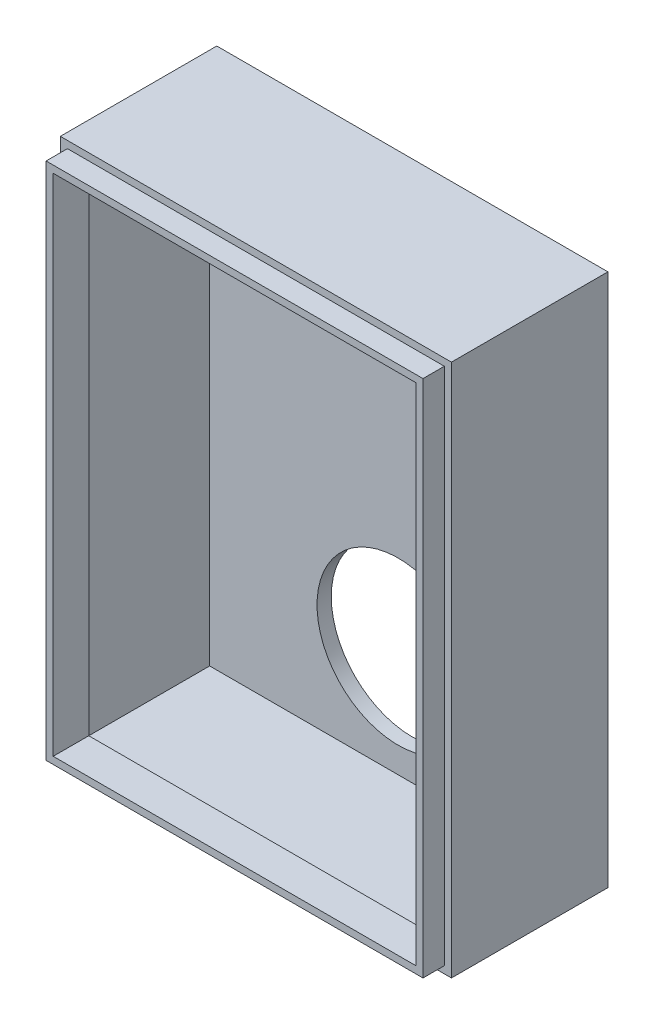
ISO-10303-21;
HEADER;
FILE_DESCRIPTION(('STEP AP214'),'2;1');
FILE_NAME('part.step','',(''),(''),'','','');
FILE_SCHEMA(('AUTOMOTIVE_DESIGN { 1 0 10303 214 1 1 1 1 }'));
ENDSEC;
DATA;
#1=APPLICATION_CONTEXT('core data for automotive mechanical design processes');
#2=APPLICATION_PROTOCOL_DEFINITION('international standard','automotive_design',2000,#1);
#3=PRODUCT_CONTEXT('',#1,'mechanical');
#4=PRODUCT('Part','Part','',(#3));
#5=PRODUCT_RELATED_PRODUCT_CATEGORY('part','',(#4));
#6=PRODUCT_DEFINITION_FORMATION('','',#4);
#7=PRODUCT_DEFINITION_CONTEXT('part definition',#1,'design');
#8=PRODUCT_DEFINITION('design','',#6,#7);
#9=PRODUCT_DEFINITION_SHAPE('','',#8);
#10=(LENGTH_UNIT() NAMED_UNIT(*) SI_UNIT(.MILLI.,.METRE.));
#11=(NAMED_UNIT(*) PLANE_ANGLE_UNIT() SI_UNIT($,.RADIAN.));
#12=(NAMED_UNIT(*) SI_UNIT($,.STERADIAN.) SOLID_ANGLE_UNIT());
#13=UNCERTAINTY_MEASURE_WITH_UNIT(LENGTH_MEASURE(1.E-05),#10,'distance_accuracy_value','');
#14=(GEOMETRIC_REPRESENTATION_CONTEXT(3) GLOBAL_UNCERTAINTY_ASSIGNED_CONTEXT((#13)) GLOBAL_UNIT_ASSIGNED_CONTEXT((#10,
#11,#12)) REPRESENTATION_CONTEXT('',''));
#15=CARTESIAN_POINT('',(0.,0.,0.));
#16=DIRECTION('',(0.,0.,1.));
#17=DIRECTION('',(1.,0.,0.));
#18=AXIS2_PLACEMENT_3D('',#15,#16,#17);
#19=CARTESIAN_POINT('',(1.,74.,20.));
#20=DIRECTION('',(-1.,0.,0.));
#21=DIRECTION('',(0.,-1.,0.));
#22=AXIS2_PLACEMENT_3D('',#19,#20,#21);
#23=PLANE('',#22);
#24=DIRECTION('',(0.,0.,1.));
#25=VECTOR('',#24,1.);
#26=CARTESIAN_POINT('',(1.00000000000001,1.,20.));
#27=LINE('',#26,#25);
#28=CARTESIAN_POINT('',(1.00000000000001,1.,20.));
#29=VERTEX_POINT('',#28);
#30=CARTESIAN_POINT('',(1.00000000000001,1.,25.));
#31=VERTEX_POINT('',#30);
#32=EDGE_CURVE('E48',#29,#31,#27,.T.);
#33=ORIENTED_EDGE('',*,*,#32,.T.);
#34=DIRECTION('',(0.,-1.,0.));
#35=VECTOR('',#34,1.);
#36=CARTESIAN_POINT('',(1.,74.,25.));
#37=LINE('',#36,#35);
#38=CARTESIAN_POINT('',(1.,74.,25.));
#39=VERTEX_POINT('',#38);
#40=EDGE_CURVE('E140',#39,#31,#37,.T.);
#41=ORIENTED_EDGE('',*,*,#40,.F.);
#42=DIRECTION('',(0.,0.,1.));
#43=VECTOR('',#42,1.);
#44=CARTESIAN_POINT('',(1.,74.,20.));
#45=LINE('',#44,#43);
#46=CARTESIAN_POINT('',(1.,74.,20.));
#47=VERTEX_POINT('',#46);
#48=EDGE_CURVE('E12',#47,#39,#45,.T.);
#49=ORIENTED_EDGE('',*,*,#48,.F.);
#50=DIRECTION('',(0.,-1.,0.));
#51=VECTOR('',#50,1.);
#52=CARTESIAN_POINT('',(1.,74.,20.));
#53=LINE('',#52,#51);
#54=EDGE_CURVE('E159',#47,#29,#53,.T.);
#55=ORIENTED_EDGE('',*,*,#54,.T.);
#56=EDGE_LOOP('',(#33,#41,#49,#55));
#57=FACE_BOUND('',#56,.T.);
#58=ADVANCED_FACE('F45',(#57),#23,.T.);
#59=CARTESIAN_POINT('',(1.,74.,20.));
#60=DIRECTION('',(0.,1.,0.));
#61=DIRECTION('',(0.,0.,1.));
#62=AXIS2_PLACEMENT_3D('',#59,#60,#61);
#63=PLANE('',#62);
#64=ORIENTED_EDGE('',*,*,#48,.T.);
#65=DIRECTION('',(-1.,0.,0.));
#66=VECTOR('',#65,1.);
#67=CARTESIAN_POINT('',(1.,74.,25.));
#68=LINE('',#67,#66);
#69=CARTESIAN_POINT('',(54.,74.,25.));
#70=VERTEX_POINT('',#69);
#71=EDGE_CURVE('E149',#70,#39,#68,.T.);
#72=ORIENTED_EDGE('',*,*,#71,.F.);
#73=DIRECTION('',(0.,0.,1.));
#74=VECTOR('',#73,1.);
#75=CARTESIAN_POINT('',(54.,74.,20.));
#76=LINE('',#75,#74);
#77=CARTESIAN_POINT('',(54.,74.,20.));
#78=VERTEX_POINT('',#77);
#79=EDGE_CURVE('E53',#78,#70,#76,.T.);
#80=ORIENTED_EDGE('',*,*,#79,.F.);
#81=DIRECTION('',(-1.,0.,0.));
#82=VECTOR('',#81,1.);
#83=CARTESIAN_POINT('',(1.,74.,20.));
#84=LINE('',#83,#82);
#85=EDGE_CURVE('E170',#78,#47,#84,.T.);
#86=ORIENTED_EDGE('',*,*,#85,.T.);
#87=EDGE_LOOP('',(#64,#72,#80,#86));
#88=FACE_BOUND('',#87,.T.);
#89=ADVANCED_FACE('F182',(#88),#63,.T.);
#90=CARTESIAN_POINT('',(54.,74.,20.));
#91=DIRECTION('',(1.,0.,0.));
#92=DIRECTION('',(0.,1.,0.));
#93=AXIS2_PLACEMENT_3D('',#90,#91,#92);
#94=PLANE('',#93);
#95=ORIENTED_EDGE('',*,*,#79,.T.);
#96=DIRECTION('',(0.,1.,0.));
#97=VECTOR('',#96,1.);
#98=CARTESIAN_POINT('',(54.,74.,25.));
#99=LINE('',#98,#97);
#100=CARTESIAN_POINT('',(54.,1.,25.));
#101=VERTEX_POINT('',#100);
#102=EDGE_CURVE('E146',#101,#70,#99,.T.);
#103=ORIENTED_EDGE('',*,*,#102,.F.);
#104=DIRECTION('',(0.,0.,1.));
#105=VECTOR('',#104,1.);
#106=CARTESIAN_POINT('',(54.,1.,20.));
#107=LINE('',#106,#105);
#108=CARTESIAN_POINT('',(54.,1.,20.));
#109=VERTEX_POINT('',#108);
#110=EDGE_CURVE('E173',#109,#101,#107,.T.);
#111=ORIENTED_EDGE('',*,*,#110,.F.);
#112=DIRECTION('',(0.,1.,0.));
#113=VECTOR('',#112,1.);
#114=CARTESIAN_POINT('',(54.,74.,20.));
#115=LINE('',#114,#113);
#116=EDGE_CURVE('E167',#109,#78,#115,.T.);
#117=ORIENTED_EDGE('',*,*,#116,.T.);
#118=EDGE_LOOP('',(#95,#103,#111,#117));
#119=FACE_BOUND('',#118,.T.);
#120=ADVANCED_FACE('F188',(#119),#94,.T.);
#121=CARTESIAN_POINT('',(1.00000000000001,1.,20.));
#122=DIRECTION('',(0.,-1.,0.));
#123=DIRECTION('',(1.,0.,0.));
#124=AXIS2_PLACEMENT_3D('',#121,#122,#123);
#125=PLANE('',#124);
#126=ORIENTED_EDGE('',*,*,#110,.T.);
#127=DIRECTION('',(1.,0.,0.));
#128=VECTOR('',#127,1.);
#129=CARTESIAN_POINT('',(1.00000000000001,1.,25.));
#130=LINE('',#129,#128);
#131=EDGE_CURVE('E143',#31,#101,#130,.T.);
#132=ORIENTED_EDGE('',*,*,#131,.F.);
#133=ORIENTED_EDGE('',*,*,#32,.F.);
#134=DIRECTION('',(1.,0.,0.));
#135=VECTOR('',#134,1.);
#136=CARTESIAN_POINT('',(1.00000000000001,1.,20.));
#137=LINE('',#136,#135);
#138=EDGE_CURVE('E164',#29,#109,#137,.T.);
#139=ORIENTED_EDGE('',*,*,#138,.T.);
#140=EDGE_LOOP('',(#126,#132,#133,#139));
#141=FACE_BOUND('',#140,.T.);
#142=ADVANCED_FACE('F177',(#141),#125,.T.);
#143=CARTESIAN_POINT('',(0.,0.,20.));
#144=DIRECTION('',(0.,0.,1.));
#145=DIRECTION('',(1.,0.,0.));
#146=AXIS2_PLACEMENT_3D('',#143,#144,#145);
#147=PLANE('',#146);
#148=DIRECTION('',(-1.,0.,0.));
#149=VECTOR('',#148,1.);
#150=CARTESIAN_POINT('',(2.,73.,20.));
#151=LINE('',#150,#149);
#152=CARTESIAN_POINT('',(53.,73.,20.));
#153=VERTEX_POINT('',#152);
#154=CARTESIAN_POINT('',(2.,73.,20.));
#155=VERTEX_POINT('',#154);
#156=EDGE_CURVE('E122',#153,#155,#151,.T.);
#157=ORIENTED_EDGE('',*,*,#156,.T.);
#158=DIRECTION('',(0.,-1.,0.));
#159=VECTOR('',#158,1.);
#160=CARTESIAN_POINT('',(2.,73.,20.));
#161=LINE('',#160,#159);
#162=CARTESIAN_POINT('',(2.00000000000001,2.,20.));
#163=VERTEX_POINT('',#162);
#164=EDGE_CURVE('E152',#155,#163,#161,.T.);
#165=ORIENTED_EDGE('',*,*,#164,.T.);
#166=DIRECTION('',(1.,0.,0.));
#167=VECTOR('',#166,1.);
#168=CARTESIAN_POINT('',(2.00000000000001,2.,20.));
#169=LINE('',#168,#167);
#170=CARTESIAN_POINT('',(53.,2.,20.));
#171=VERTEX_POINT('',#170);
#172=EDGE_CURVE('E117',#163,#171,#169,.T.);
#173=ORIENTED_EDGE('',*,*,#172,.T.);
#174=DIRECTION('',(0.,1.,0.));
#175=VECTOR('',#174,1.);
#176=CARTESIAN_POINT('',(53.,73.,20.));
#177=LINE('',#176,#175);
#178=EDGE_CURVE('E61',#171,#153,#177,.T.);
#179=ORIENTED_EDGE('',*,*,#178,.T.);
#180=EDGE_LOOP('',(#157,#165,#173,#179));
#181=FACE_BOUND('',#180,.T.);
#182=ORIENTED_EDGE('',*,*,#54,.F.);
#183=ORIENTED_EDGE('',*,*,#85,.F.);
#184=ORIENTED_EDGE('',*,*,#116,.F.);
#185=ORIENTED_EDGE('',*,*,#138,.F.);
#186=EDGE_LOOP('',(#182,#183,#184,#185));
#187=FACE_BOUND('',#186,.T.);
#188=ADVANCED_FACE('F186',(#181,#187),#147,.F.);
#189=CARTESIAN_POINT('',(2.,73.,20.));
#190=DIRECTION('',(-1.,0.,0.));
#191=DIRECTION('',(0.,-1.,0.));
#192=AXIS2_PLACEMENT_3D('',#189,#190,#191);
#193=PLANE('',#192);
#194=DIRECTION('',(0.,0.,1.));
#195=VECTOR('',#194,1.);
#196=CARTESIAN_POINT('',(2.,73.,20.));
#197=LINE('',#196,#195);
#198=CARTESIAN_POINT('',(2.,73.,25.));
#199=VERTEX_POINT('',#198);
#200=EDGE_CURVE('E127',#155,#199,#197,.T.);
#201=ORIENTED_EDGE('',*,*,#200,.T.);
#202=DIRECTION('',(0.,-1.,0.));
#203=VECTOR('',#202,1.);
#204=CARTESIAN_POINT('',(2.,73.,25.));
#205=LINE('',#204,#203);
#206=CARTESIAN_POINT('',(2.00000000000001,2.,25.));
#207=VERTEX_POINT('',#206);
#208=EDGE_CURVE('E125',#199,#207,#205,.T.);
#209=ORIENTED_EDGE('',*,*,#208,.T.);
#210=DIRECTION('',(0.,0.,1.));
#211=VECTOR('',#210,1.);
#212=CARTESIAN_POINT('',(2.00000000000001,2.,20.));
#213=LINE('',#212,#211);
#214=EDGE_CURVE('E110',#163,#207,#213,.T.);
#215=ORIENTED_EDGE('',*,*,#214,.F.);
#216=ORIENTED_EDGE('',*,*,#164,.F.);
#217=EDGE_LOOP('',(#201,#209,#215,#216));
#218=FACE_BOUND('',#217,.T.);
#219=ADVANCED_FACE('F126',(#218),#193,.F.);
#220=CARTESIAN_POINT('',(2.,73.,20.));
#221=DIRECTION('',(0.,1.,0.));
#222=DIRECTION('',(0.,0.,1.));
#223=AXIS2_PLACEMENT_3D('',#220,#221,#222);
#224=PLANE('',#223);
#225=DIRECTION('',(0.,0.,1.));
#226=VECTOR('',#225,1.);
#227=CARTESIAN_POINT('',(53.,73.,20.));
#228=LINE('',#227,#226);
#229=CARTESIAN_POINT('',(53.,73.,25.));
#230=VERTEX_POINT('',#229);
#231=EDGE_CURVE('E160',#153,#230,#228,.T.);
#232=ORIENTED_EDGE('',*,*,#231,.T.);
#233=DIRECTION('',(-1.,0.,0.));
#234=VECTOR('',#233,1.);
#235=CARTESIAN_POINT('',(2.,73.,25.));
#236=LINE('',#235,#234);
#237=EDGE_CURVE('E136',#230,#199,#236,.T.);
#238=ORIENTED_EDGE('',*,*,#237,.T.);
#239=ORIENTED_EDGE('',*,*,#200,.F.);
#240=ORIENTED_EDGE('',*,*,#156,.F.);
#241=EDGE_LOOP('',(#232,#238,#239,#240));
#242=FACE_BOUND('',#241,.T.);
#243=ADVANCED_FACE('F231',(#242),#224,.F.);
#244=CARTESIAN_POINT('',(53.,73.,20.));
#245=DIRECTION('',(1.,0.,0.));
#246=DIRECTION('',(0.,0.,-1.));
#247=AXIS2_PLACEMENT_3D('',#244,#245,#246);
#248=PLANE('',#247);
#249=DIRECTION('',(0.,0.,1.));
#250=VECTOR('',#249,1.);
#251=CARTESIAN_POINT('',(53.,2.,20.));
#252=LINE('',#251,#250);
#253=CARTESIAN_POINT('',(53.,2.,25.));
#254=VERTEX_POINT('',#253);
#255=EDGE_CURVE('E121',#171,#254,#252,.T.);
#256=ORIENTED_EDGE('',*,*,#255,.T.);
#257=DIRECTION('',(0.,1.,0.));
#258=VECTOR('',#257,1.);
#259=CARTESIAN_POINT('',(53.,73.,25.));
#260=LINE('',#259,#258);
#261=EDGE_CURVE('E134',#254,#230,#260,.T.);
#262=ORIENTED_EDGE('',*,*,#261,.T.);
#263=ORIENTED_EDGE('',*,*,#231,.F.);
#264=ORIENTED_EDGE('',*,*,#178,.F.);
#265=EDGE_LOOP('',(#256,#262,#263,#264));
#266=FACE_BOUND('',#265,.T.);
#267=ADVANCED_FACE('F240',(#266),#248,.F.);
#268=CARTESIAN_POINT('',(2.00000000000001,2.,20.));
#269=DIRECTION('',(0.,-1.,0.));
#270=DIRECTION('',(1.,0.,0.));
#271=AXIS2_PLACEMENT_3D('',#268,#269,#270);
#272=PLANE('',#271);
#273=ORIENTED_EDGE('',*,*,#214,.T.);
#274=DIRECTION('',(1.,0.,0.));
#275=VECTOR('',#274,1.);
#276=CARTESIAN_POINT('',(2.00000000000001,2.,25.));
#277=LINE('',#276,#275);
#278=EDGE_CURVE('E114',#207,#254,#277,.T.);
#279=ORIENTED_EDGE('',*,*,#278,.T.);
#280=ORIENTED_EDGE('',*,*,#255,.F.);
#281=ORIENTED_EDGE('',*,*,#172,.F.);
#282=EDGE_LOOP('',(#273,#279,#280,#281));
#283=FACE_BOUND('',#282,.T.);
#284=ADVANCED_FACE('F112',(#283),#272,.F.);
#285=CARTESIAN_POINT('',(0.,0.,25.));
#286=DIRECTION('',(0.,0.,1.));
#287=DIRECTION('',(1.,0.,0.));
#288=AXIS2_PLACEMENT_3D('',#285,#286,#287);
#289=PLANE('',#288);
#290=ORIENTED_EDGE('',*,*,#40,.T.);
#291=ORIENTED_EDGE('',*,*,#131,.T.);
#292=ORIENTED_EDGE('',*,*,#102,.T.);
#293=ORIENTED_EDGE('',*,*,#71,.T.);
#294=EDGE_LOOP('',(#290,#291,#292,#293));
#295=FACE_BOUND('',#294,.T.);
#296=ORIENTED_EDGE('',*,*,#278,.F.);
#297=ORIENTED_EDGE('',*,*,#208,.F.);
#298=ORIENTED_EDGE('',*,*,#237,.F.);
#299=ORIENTED_EDGE('',*,*,#261,.F.);
#300=EDGE_LOOP('',(#296,#297,#298,#299));
#301=FACE_BOUND('',#300,.T.);
#302=ADVANCED_FACE('F132',(#295,#301),#289,.T.);
#303=CLOSED_SHELL('',(#58,#89,#120,#142,#188,#219,#243,#267,#284,#302));
#304=MANIFOLD_SOLID_BREP('B2',#303);
#305=CARTESIAN_POINT('',(0.,0.,2.));
#306=DIRECTION('',(1.,0.,0.));
#307=DIRECTION('',(0.,0.,-1.));
#308=AXIS2_PLACEMENT_3D('',#305,#306,#307);
#309=PLANE('',#308);
#310=DIRECTION('',(0.,-1.,0.));
#311=VECTOR('',#310,1.);
#312=CARTESIAN_POINT('',(0.,0.,0.));
#313=LINE('',#312,#311);
#314=CARTESIAN_POINT('',(0.,75.,0.));
#315=VERTEX_POINT('',#314);
#316=CARTESIAN_POINT('',(0.,0.,0.));
#317=VERTEX_POINT('',#316);
#318=EDGE_CURVE('E394',#315,#317,#313,.T.);
#319=ORIENTED_EDGE('',*,*,#318,.T.);
#320=DIRECTION('',(0.,0.,-1.));
#321=VECTOR('',#320,1.);
#322=CARTESIAN_POINT('',(0.,0.,2.));
#323=LINE('',#322,#321);
#324=CARTESIAN_POINT('',(0.,0.,22.));
#325=VERTEX_POINT('',#324);
#326=EDGE_CURVE('E43',#325,#317,#323,.T.);
#327=ORIENTED_EDGE('',*,*,#326,.F.);
#328=DIRECTION('',(0.,-1.,0.));
#329=VECTOR('',#328,1.);
#330=CARTESIAN_POINT('',(0.,75.,22.));
#331=LINE('',#330,#329);
#332=CARTESIAN_POINT('',(0.,75.,22.));
#333=VERTEX_POINT('',#332);
#334=EDGE_CURVE('E357',#333,#325,#331,.T.);
#335=ORIENTED_EDGE('',*,*,#334,.F.);
#336=DIRECTION('',(0.,0.,-1.));
#337=VECTOR('',#336,1.);
#338=CARTESIAN_POINT('',(0.,75.,2.));
#339=LINE('',#338,#337);
#340=EDGE_CURVE('E402',#333,#315,#339,.T.);
#341=ORIENTED_EDGE('',*,*,#340,.T.);
#342=EDGE_LOOP('',(#319,#327,#335,#341));
#343=FACE_BOUND('',#342,.T.);
#344=ADVANCED_FACE('F275',(#343),#309,.F.);
#345=CARTESIAN_POINT('',(0.,0.,2.));
#346=DIRECTION('',(0.,1.,0.));
#347=DIRECTION('',(0.,0.,1.));
#348=AXIS2_PLACEMENT_3D('',#345,#346,#347);
#349=PLANE('',#348);
#350=DIRECTION('',(1.,0.,0.));
#351=VECTOR('',#350,1.);
#352=CARTESIAN_POINT('',(0.,0.,0.));
#353=LINE('',#352,#351);
#354=CARTESIAN_POINT('',(55.,0.,0.));
#355=VERTEX_POINT('',#354);
#356=EDGE_CURVE('E397',#317,#355,#353,.T.);
#357=ORIENTED_EDGE('',*,*,#356,.T.);
#358=DIRECTION('',(0.,0.,-1.));
#359=VECTOR('',#358,1.);
#360=CARTESIAN_POINT('',(55.,0.,2.));
#361=LINE('',#360,#359);
#362=CARTESIAN_POINT('',(55.,0.,22.));
#363=VERTEX_POINT('',#362);
#364=EDGE_CURVE('E282',#363,#355,#361,.T.);
#365=ORIENTED_EDGE('',*,*,#364,.F.);
#366=DIRECTION('',(1.,0.,0.));
#367=VECTOR('',#366,1.);
#368=CARTESIAN_POINT('',(0.,0.,22.));
#369=LINE('',#368,#367);
#370=EDGE_CURVE('E385',#325,#363,#369,.T.);
#371=ORIENTED_EDGE('',*,*,#370,.F.);
#372=ORIENTED_EDGE('',*,*,#326,.T.);
#373=EDGE_LOOP('',(#357,#365,#371,#372));
#374=FACE_BOUND('',#373,.T.);
#375=ADVANCED_FACE('F420',(#374),#349,.F.);
#376=CARTESIAN_POINT('',(55.,0.,2.));
#377=DIRECTION('',(-1.,0.,0.));
#378=DIRECTION('',(0.,0.,1.));
#379=AXIS2_PLACEMENT_3D('',#376,#377,#378);
#380=PLANE('',#379);
#381=DIRECTION('',(0.,1.,0.));
#382=VECTOR('',#381,1.);
#383=CARTESIAN_POINT('',(55.,0.,0.));
#384=LINE('',#383,#382);
#385=CARTESIAN_POINT('',(55.,75.,0.));
#386=VERTEX_POINT('',#385);
#387=EDGE_CURVE('E399',#355,#386,#384,.T.);
#388=ORIENTED_EDGE('',*,*,#387,.T.);
#389=DIRECTION('',(0.,0.,-1.));
#390=VECTOR('',#389,1.);
#391=CARTESIAN_POINT('',(55.,75.,2.));
#392=LINE('',#391,#390);
#393=CARTESIAN_POINT('',(55.,75.,22.));
#394=VERTEX_POINT('',#393);
#395=EDGE_CURVE('E404',#394,#386,#392,.T.);
#396=ORIENTED_EDGE('',*,*,#395,.F.);
#397=DIRECTION('',(0.,1.,0.));
#398=VECTOR('',#397,1.);
#399=CARTESIAN_POINT('',(55.,75.,22.));
#400=LINE('',#399,#398);
#401=EDGE_CURVE('E388',#363,#394,#400,.T.);
#402=ORIENTED_EDGE('',*,*,#401,.F.);
#403=ORIENTED_EDGE('',*,*,#364,.T.);
#404=EDGE_LOOP('',(#388,#396,#402,#403));
#405=FACE_BOUND('',#404,.T.);
#406=ADVANCED_FACE('F409',(#405),#380,.F.);
#407=CARTESIAN_POINT('',(0.,75.,2.));
#408=DIRECTION('',(0.,-1.,0.));
#409=DIRECTION('',(0.,0.,-1.));
#410=AXIS2_PLACEMENT_3D('',#407,#408,#409);
#411=PLANE('',#410);
#412=DIRECTION('',(-1.,0.,0.));
#413=VECTOR('',#412,1.);
#414=CARTESIAN_POINT('',(0.,75.,0.));
#415=LINE('',#414,#413);
#416=EDGE_CURVE('E297',#386,#315,#415,.T.);
#417=ORIENTED_EDGE('',*,*,#416,.T.);
#418=ORIENTED_EDGE('',*,*,#340,.F.);
#419=DIRECTION('',(-1.,0.,0.));
#420=VECTOR('',#419,1.);
#421=CARTESIAN_POINT('',(0.,75.,22.));
#422=LINE('',#421,#420);
#423=EDGE_CURVE('E391',#394,#333,#422,.T.);
#424=ORIENTED_EDGE('',*,*,#423,.F.);
#425=ORIENTED_EDGE('',*,*,#395,.T.);
#426=EDGE_LOOP('',(#417,#418,#424,#425));
#427=FACE_BOUND('',#426,.T.);
#428=ADVANCED_FACE('F418',(#427),#411,.F.);
#429=CARTESIAN_POINT('',(0.,0.,0.));
#430=DIRECTION('',(0.,0.,-1.));
#431=DIRECTION('',(-1.,0.,0.));
#432=AXIS2_PLACEMENT_3D('',#429,#430,#431);
#433=PLANE('',#432);
#434=CARTESIAN_POINT('',(27.5,63.,0.));
#435=DIRECTION('',(0.,0.,-1.));
#436=DIRECTION('',(-1.,0.,0.));
#437=AXIS2_PLACEMENT_3D('',#434,#435,#436);
#438=CIRCLE('',#437,4.);
#439=CARTESIAN_POINT('',(23.5,63.,0.));
#440=VERTEX_POINT('',#439);
#441=EDGE_CURVE('E462',#440,#440,#438,.T.);
#442=ORIENTED_EDGE('',*,*,#441,.F.);
#443=EDGE_LOOP('',(#442));
#444=FACE_BOUND('',#443,.T.);
#445=CARTESIAN_POINT('',(27.5,16.,0.));
#446=DIRECTION('',(0.,0.,-1.));
#447=DIRECTION('',(-1.,0.,0.));
#448=AXIS2_PLACEMENT_3D('',#445,#446,#447);
#449=CIRCLE('',#448,11.4);
#450=CARTESIAN_POINT('',(16.1,16.,0.));
#451=VERTEX_POINT('',#450);
#452=EDGE_CURVE('E372',#451,#451,#449,.T.);
#453=ORIENTED_EDGE('',*,*,#452,.F.);
#454=EDGE_LOOP('',(#453));
#455=FACE_BOUND('',#454,.T.);
#456=ORIENTED_EDGE('',*,*,#318,.F.);
#457=ORIENTED_EDGE('',*,*,#416,.F.);
#458=ORIENTED_EDGE('',*,*,#387,.F.);
#459=ORIENTED_EDGE('',*,*,#356,.F.);
#460=EDGE_LOOP('',(#456,#457,#458,#459));
#461=FACE_BOUND('',#460,.T.);
#462=ADVANCED_FACE('F414',(#444,#455,#461),#433,.T.);
#463=CARTESIAN_POINT('',(0.,0.,22.));
#464=DIRECTION('',(0.,0.,1.));
#465=DIRECTION('',(1.,0.,0.));
#466=AXIS2_PLACEMENT_3D('',#463,#464,#465);
#467=PLANE('',#466);
#468=ORIENTED_EDGE('',*,*,#334,.T.);
#469=ORIENTED_EDGE('',*,*,#370,.T.);
#470=ORIENTED_EDGE('',*,*,#401,.T.);
#471=ORIENTED_EDGE('',*,*,#423,.T.);
#472=EDGE_LOOP('',(#468,#469,#470,#471));
#473=FACE_BOUND('',#472,.T.);
#474=DIRECTION('',(1.,0.,0.));
#475=VECTOR('',#474,1.);
#476=CARTESIAN_POINT('',(1.00000000000001,1.,22.));
#477=LINE('',#476,#475);
#478=CARTESIAN_POINT('',(1.00000000000001,1.,22.));
#479=VERTEX_POINT('',#478);
#480=CARTESIAN_POINT('',(54.,1.,22.));
#481=VERTEX_POINT('',#480);
#482=EDGE_CURVE('E349',#479,#481,#477,.T.);
#483=ORIENTED_EDGE('',*,*,#482,.F.);
#484=DIRECTION('',(0.,-1.,0.));
#485=VECTOR('',#484,1.);
#486=CARTESIAN_POINT('',(1.,74.,22.));
#487=LINE('',#486,#485);
#488=CARTESIAN_POINT('',(1.,74.,22.));
#489=VERTEX_POINT('',#488);
#490=EDGE_CURVE('E341',#489,#479,#487,.T.);
#491=ORIENTED_EDGE('',*,*,#490,.F.);
#492=DIRECTION('',(-1.,0.,0.));
#493=VECTOR('',#492,1.);
#494=CARTESIAN_POINT('',(1.,74.,22.));
#495=LINE('',#494,#493);
#496=CARTESIAN_POINT('',(54.,74.,22.));
#497=VERTEX_POINT('',#496);
#498=EDGE_CURVE('E365',#497,#489,#495,.T.);
#499=ORIENTED_EDGE('',*,*,#498,.F.);
#500=DIRECTION('',(0.,1.,0.));
#501=VECTOR('',#500,1.);
#502=CARTESIAN_POINT('',(54.,74.,22.));
#503=LINE('',#502,#501);
#504=EDGE_CURVE('E363',#481,#497,#503,.T.);
#505=ORIENTED_EDGE('',*,*,#504,.F.);
#506=EDGE_LOOP('',(#483,#491,#499,#505));
#507=FACE_BOUND('',#506,.T.);
#508=ADVANCED_FACE('F361',(#473,#507),#467,.T.);
#509=CARTESIAN_POINT('',(1.,74.,22.));
#510=DIRECTION('',(1.,0.,0.));
#511=DIRECTION('',(0.,1.,0.));
#512=AXIS2_PLACEMENT_3D('',#509,#510,#511);
#513=PLANE('',#512);
#514=DIRECTION('',(0.,-1.,0.));
#515=VECTOR('',#514,1.);
#516=CARTESIAN_POINT('',(1.,74.,2.));
#517=LINE('',#516,#515);
#518=CARTESIAN_POINT('',(1.,74.,2.));
#519=VERTEX_POINT('',#518);
#520=CARTESIAN_POINT('',(1.00000000000001,1.,2.));
#521=VERTEX_POINT('',#520);
#522=EDGE_CURVE('E370',#519,#521,#517,.T.);
#523=ORIENTED_EDGE('',*,*,#522,.F.);
#524=DIRECTION('',(0.,0.,-1.));
#525=VECTOR('',#524,1.);
#526=CARTESIAN_POINT('',(1.,74.,22.));
#527=LINE('',#526,#525);
#528=EDGE_CURVE('E289',#489,#519,#527,.T.);
#529=ORIENTED_EDGE('',*,*,#528,.F.);
#530=ORIENTED_EDGE('',*,*,#490,.T.);
#531=DIRECTION('',(0.,0.,-1.));
#532=VECTOR('',#531,1.);
#533=CARTESIAN_POINT('',(1.00000000000001,1.,22.));
#534=LINE('',#533,#532);
#535=EDGE_CURVE('E344',#479,#521,#534,.T.);
#536=ORIENTED_EDGE('',*,*,#535,.T.);
#537=EDGE_LOOP('',(#523,#529,#530,#536));
#538=FACE_BOUND('',#537,.T.);
#539=ADVANCED_FACE('F343',(#538),#513,.T.);
#540=CARTESIAN_POINT('',(1.00000000000001,1.,22.));
#541=DIRECTION('',(0.,1.,0.));
#542=DIRECTION('',(-1.,0.,0.));
#543=AXIS2_PLACEMENT_3D('',#540,#541,#542);
#544=PLANE('',#543);
#545=DIRECTION('',(1.,0.,0.));
#546=VECTOR('',#545,1.);
#547=CARTESIAN_POINT('',(1.00000000000001,1.,2.));
#548=LINE('',#547,#546);
#549=CARTESIAN_POINT('',(54.,1.,2.));
#550=VERTEX_POINT('',#549);
#551=EDGE_CURVE('E356',#521,#550,#548,.T.);
#552=ORIENTED_EDGE('',*,*,#551,.F.);
#553=ORIENTED_EDGE('',*,*,#535,.F.);
#554=ORIENTED_EDGE('',*,*,#482,.T.);
#555=DIRECTION('',(0.,0.,-1.));
#556=VECTOR('',#555,1.);
#557=CARTESIAN_POINT('',(54.,1.,22.));
#558=LINE('',#557,#556);
#559=EDGE_CURVE('E358',#481,#550,#558,.T.);
#560=ORIENTED_EDGE('',*,*,#559,.T.);
#561=EDGE_LOOP('',(#552,#553,#554,#560));
#562=FACE_BOUND('',#561,.T.);
#563=ADVANCED_FACE('F353',(#562),#544,.T.);
#564=CARTESIAN_POINT('',(54.,74.,22.));
#565=DIRECTION('',(-1.,0.,0.));
#566=DIRECTION('',(0.,-1.,0.));
#567=AXIS2_PLACEMENT_3D('',#564,#565,#566);
#568=PLANE('',#567);
#569=DIRECTION('',(0.,1.,0.));
#570=VECTOR('',#569,1.);
#571=CARTESIAN_POINT('',(54.,74.,2.));
#572=LINE('',#571,#570);
#573=CARTESIAN_POINT('',(54.,74.,2.));
#574=VERTEX_POINT('',#573);
#575=EDGE_CURVE('E374',#550,#574,#572,.T.);
#576=ORIENTED_EDGE('',*,*,#575,.F.);
#577=ORIENTED_EDGE('',*,*,#559,.F.);
#578=ORIENTED_EDGE('',*,*,#504,.T.);
#579=DIRECTION('',(0.,0.,-1.));
#580=VECTOR('',#579,1.);
#581=CARTESIAN_POINT('',(54.,74.,22.));
#582=LINE('',#581,#580);
#583=EDGE_CURVE('E380',#497,#574,#582,.T.);
#584=ORIENTED_EDGE('',*,*,#583,.T.);
#585=EDGE_LOOP('',(#576,#577,#578,#584));
#586=FACE_BOUND('',#585,.T.);
#587=ADVANCED_FACE('F445',(#586),#568,.T.);
#588=CARTESIAN_POINT('',(1.,74.,22.));
#589=DIRECTION('',(0.,-1.,0.));
#590=DIRECTION('',(0.,0.,-1.));
#591=AXIS2_PLACEMENT_3D('',#588,#589,#590);
#592=PLANE('',#591);
#593=DIRECTION('',(-1.,0.,0.));
#594=VECTOR('',#593,1.);
#595=CARTESIAN_POINT('',(1.,74.,2.));
#596=LINE('',#595,#594);
#597=EDGE_CURVE('E350',#574,#519,#596,.T.);
#598=ORIENTED_EDGE('',*,*,#597,.F.);
#599=ORIENTED_EDGE('',*,*,#583,.F.);
#600=ORIENTED_EDGE('',*,*,#498,.T.);
#601=ORIENTED_EDGE('',*,*,#528,.T.);
#602=EDGE_LOOP('',(#598,#599,#600,#601));
#603=FACE_BOUND('',#602,.T.);
#604=ADVANCED_FACE('F437',(#603),#592,.T.);
#605=CARTESIAN_POINT('',(0.,0.,2.));
#606=DIRECTION('',(0.,0.,-1.));
#607=DIRECTION('',(-1.,0.,0.));
#608=AXIS2_PLACEMENT_3D('',#605,#606,#607);
#609=PLANE('',#608);
#610=CARTESIAN_POINT('',(27.5,63.,2.));
#611=DIRECTION('',(0.,0.,1.));
#612=DIRECTION('',(1.,0.,0.));
#613=AXIS2_PLACEMENT_3D('',#610,#611,#612);
#614=CIRCLE('',#613,4.);
#615=CARTESIAN_POINT('',(31.5,63.,2.));
#616=VERTEX_POINT('',#615);
#617=EDGE_CURVE('E465',#616,#616,#614,.T.);
#618=ORIENTED_EDGE('',*,*,#617,.F.);
#619=EDGE_LOOP('',(#618));
#620=FACE_BOUND('',#619,.T.);
#621=CARTESIAN_POINT('',(27.5,16.,2.));
#622=DIRECTION('',(0.,0.,1.));
#623=DIRECTION('',(1.,0.,0.));
#624=AXIS2_PLACEMENT_3D('',#621,#622,#623);
#625=CIRCLE('',#624,11.4);
#626=CARTESIAN_POINT('',(38.9,16.,2.));
#627=VERTEX_POINT('',#626);
#628=EDGE_CURVE('E467',#627,#627,#625,.T.);
#629=ORIENTED_EDGE('',*,*,#628,.F.);
#630=EDGE_LOOP('',(#629));
#631=FACE_BOUND('',#630,.T.);
#632=ORIENTED_EDGE('',*,*,#597,.T.);
#633=ORIENTED_EDGE('',*,*,#522,.T.);
#634=ORIENTED_EDGE('',*,*,#551,.T.);
#635=ORIENTED_EDGE('',*,*,#575,.T.);
#636=EDGE_LOOP('',(#632,#633,#634,#635));
#637=FACE_BOUND('',#636,.T.);
#638=ADVANCED_FACE('F433',(#620,#631,#637),#609,.F.);
#639=CARTESIAN_POINT('',(27.5,16.,-1.));
#640=DIRECTION('',(0.,0.,1.));
#641=DIRECTION('',(1.,0.,0.));
#642=AXIS2_PLACEMENT_3D('',#639,#640,#641);
#643=CYLINDRICAL_SURFACE('',#642,11.4);
#644=ORIENTED_EDGE('',*,*,#452,.T.);
#645=EDGE_LOOP('',(#644));
#646=FACE_BOUND('',#645,.T.);
#647=ORIENTED_EDGE('',*,*,#628,.T.);
#648=EDGE_LOOP('',(#647));
#649=FACE_BOUND('',#648,.T.);
#650=ADVANCED_FACE('F436',(#646,#649),#643,.F.);
#651=CARTESIAN_POINT('',(27.5,63.,-1.));
#652=DIRECTION('',(0.,0.,1.));
#653=DIRECTION('',(1.,0.,0.));
#654=AXIS2_PLACEMENT_3D('',#651,#652,#653);
#655=CYLINDRICAL_SURFACE('',#654,4.);
#656=ORIENTED_EDGE('',*,*,#441,.T.);
#657=EDGE_LOOP('',(#656));
#658=FACE_BOUND('',#657,.T.);
#659=ORIENTED_EDGE('',*,*,#617,.T.);
#660=EDGE_LOOP('',(#659));
#661=FACE_BOUND('',#660,.T.);
#662=ADVANCED_FACE('F453',(#658,#661),#655,.F.);
#663=CLOSED_SHELL('',(#344,#375,#406,#428,#462,#508,#539,#563,#587,#604,#638,#650,#662));
#664=MANIFOLD_SOLID_BREP('B6',#663);
#665=ADVANCED_BREP_SHAPE_REPRESENTATION('',(#18,#304,#664),#14);
#666=SHAPE_DEFINITION_REPRESENTATION(#9,#665);
ENDSEC;
END-ISO-10303-21;
